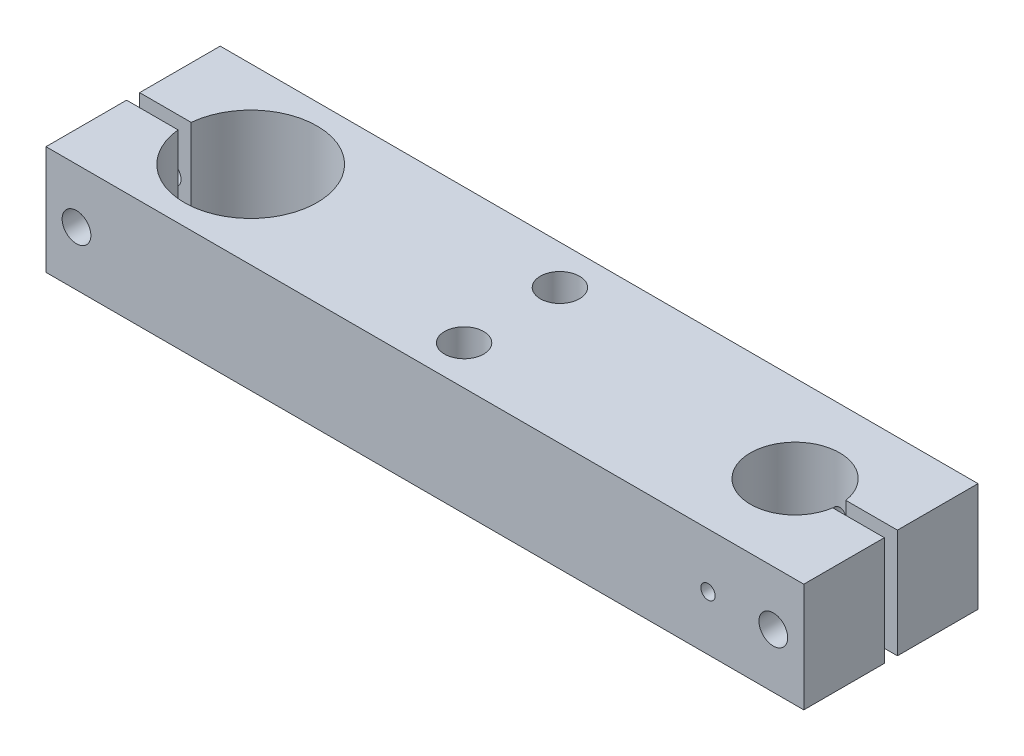
ISO-10303-21;
HEADER;
FILE_DESCRIPTION(('STEP AP214'),'2;1');
FILE_NAME('part.step','',(''),(''),'','','');
FILE_SCHEMA(('AUTOMOTIVE_DESIGN { 1 0 10303 214 1 1 1 1 }'));
ENDSEC;
DATA;
#1=APPLICATION_CONTEXT('core data for automotive mechanical design processes');
#2=APPLICATION_PROTOCOL_DEFINITION('international standard','automotive_design',2000,#1);
#3=PRODUCT_CONTEXT('',#1,'mechanical');
#4=PRODUCT('Part','Part','',(#3));
#5=PRODUCT_RELATED_PRODUCT_CATEGORY('part','',(#4));
#6=PRODUCT_DEFINITION_FORMATION('','',#4);
#7=PRODUCT_DEFINITION_CONTEXT('part definition',#1,'design');
#8=PRODUCT_DEFINITION('design','',#6,#7);
#9=PRODUCT_DEFINITION_SHAPE('','',#8);
#10=(LENGTH_UNIT() NAMED_UNIT(*) SI_UNIT(.MILLI.,.METRE.));
#11=(NAMED_UNIT(*) PLANE_ANGLE_UNIT() SI_UNIT($,.RADIAN.));
#12=(NAMED_UNIT(*) SI_UNIT($,.STERADIAN.) SOLID_ANGLE_UNIT());
#13=UNCERTAINTY_MEASURE_WITH_UNIT(LENGTH_MEASURE(1.E-05),#10,'distance_accuracy_value','');
#14=(GEOMETRIC_REPRESENTATION_CONTEXT(3) GLOBAL_UNCERTAINTY_ASSIGNED_CONTEXT((#13)) GLOBAL_UNIT_ASSIGNED_CONTEXT((#10,
#11,#12)) REPRESENTATION_CONTEXT('',''));
#15=CARTESIAN_POINT('',(0.,0.,0.));
#16=DIRECTION('',(0.,0.,1.));
#17=DIRECTION('',(1.,0.,0.));
#18=AXIS2_PLACEMENT_3D('',#15,#16,#17);
#19=CARTESIAN_POINT('',(0.,25.,20.));
#20=DIRECTION('',(0.,0.,-1.));
#21=DIRECTION('',(-1.,0.,0.));
#22=AXIS2_PLACEMENT_3D('',#19,#20,#21);
#23=PLANE('',#22);
#24=CARTESIAN_POINT('',(65.,12.5,20.));
#25=DIRECTION('',(0.,0.,1.));
#26=DIRECTION('',(1.,0.,0.));
#27=AXIS2_PLACEMENT_3D('',#24,#25,#26);
#28=CIRCLE('',#27,1.65);
#29=CARTESIAN_POINT('',(66.65,12.5,20.));
#30=VERTEX_POINT('',#29);
#31=EDGE_CURVE('E206',#30,#30,#28,.T.);
#32=ORIENTED_EDGE('',*,*,#31,.F.);
#33=EDGE_LOOP('',(#32));
#34=FACE_BOUND('',#33,.T.);
#35=CARTESIAN_POINT('',(-79.9999999999999,12.5,20.));
#36=DIRECTION('',(0.,0.,1.));
#37=DIRECTION('',(1.,0.,0.));
#38=AXIS2_PLACEMENT_3D('',#35,#36,#37);
#39=CIRCLE('',#38,3.3);
#40=CARTESIAN_POINT('',(-76.6999999999999,12.5,20.));
#41=VERTEX_POINT('',#40);
#42=EDGE_CURVE('E181',#41,#41,#39,.T.);
#43=ORIENTED_EDGE('',*,*,#42,.F.);
#44=EDGE_LOOP('',(#43));
#45=FACE_BOUND('',#44,.T.);
#46=DIRECTION('',(1.,0.,0.));
#47=VECTOR('',#46,1.);
#48=CARTESIAN_POINT('',(0.,0.,20.));
#49=LINE('',#48,#47);
#50=CARTESIAN_POINT('',(-87.,0.,20.));
#51=VERTEX_POINT('',#50);
#52=CARTESIAN_POINT('',(87.,0.,20.));
#53=VERTEX_POINT('',#52);
#54=EDGE_CURVE('E276',#51,#53,#49,.T.);
#55=ORIENTED_EDGE('',*,*,#54,.T.);
#56=DIRECTION('',(0.,-1.,0.));
#57=VECTOR('',#56,1.);
#58=CARTESIAN_POINT('',(87.,25.,20.));
#59=LINE('',#58,#57);
#60=CARTESIAN_POINT('',(87.,25.,20.));
#61=VERTEX_POINT('',#60);
#62=EDGE_CURVE('E303',#61,#53,#59,.T.);
#63=ORIENTED_EDGE('',*,*,#62,.F.);
#64=DIRECTION('',(1.,0.,0.));
#65=VECTOR('',#64,1.);
#66=CARTESIAN_POINT('',(0.,25.,20.));
#67=LINE('',#66,#65);
#68=CARTESIAN_POINT('',(-87.,25.,20.));
#69=VERTEX_POINT('',#68);
#70=EDGE_CURVE('E165',#69,#61,#67,.T.);
#71=ORIENTED_EDGE('',*,*,#70,.F.);
#72=DIRECTION('',(0.,-1.,0.));
#73=VECTOR('',#72,1.);
#74=CARTESIAN_POINT('',(-87.,25.,20.));
#75=LINE('',#74,#73);
#76=EDGE_CURVE('E306',#69,#51,#75,.T.);
#77=ORIENTED_EDGE('',*,*,#76,.T.);
#78=EDGE_LOOP('',(#55,#63,#71,#77));
#79=FACE_BOUND('',#78,.T.);
#80=CARTESIAN_POINT('',(80.,12.5,20.));
#81=DIRECTION('',(0.,0.,1.));
#82=DIRECTION('',(1.,0.,0.));
#83=AXIS2_PLACEMENT_3D('',#80,#81,#82);
#84=CIRCLE('',#83,3.3);
#85=CARTESIAN_POINT('',(83.3,12.5,20.));
#86=VERTEX_POINT('',#85);
#87=EDGE_CURVE('E187',#86,#86,#84,.T.);
#88=ORIENTED_EDGE('',*,*,#87,.F.);
#89=EDGE_LOOP('',(#88));
#90=FACE_BOUND('',#89,.T.);
#91=ADVANCED_FACE('F39',(#34,#45,#79,#90),#23,.F.);
#92=CARTESIAN_POINT('',(-60.,25.,0.));
#93=DIRECTION('',(0.,-1.,0.));
#94=DIRECTION('',(0.,0.,-1.));
#95=AXIS2_PLACEMENT_3D('',#92,#93,#94);
#96=CYLINDRICAL_SURFACE('',#95,15.25);
#97=CARTESIAN_POINT('',(-60.,0.,0.));
#98=DIRECTION('',(0.,1.,0.));
#99=DIRECTION('',(0.,0.,1.));
#100=AXIS2_PLACEMENT_3D('',#97,#98,#99);
#101=CIRCLE('',#100,15.25);
#102=CARTESIAN_POINT('',(-75.1760502107762,0.,1.5));
#103=VERTEX_POINT('',#102);
#104=CARTESIAN_POINT('',(-75.1760502107762,0.,-1.5));
#105=VERTEX_POINT('',#104);
#106=EDGE_CURVE('E180',#103,#105,#101,.T.);
#107=ORIENTED_EDGE('',*,*,#106,.F.);
#108=DIRECTION('',(0.,-1.,0.));
#109=VECTOR('',#108,1.);
#110=CARTESIAN_POINT('',(-75.1760502107762,25.,1.5));
#111=LINE('',#110,#109);
#112=CARTESIAN_POINT('',(-75.1760502107762,25.,1.5));
#113=VERTEX_POINT('',#112);
#114=EDGE_CURVE('E11',#113,#103,#111,.T.);
#115=ORIENTED_EDGE('',*,*,#114,.F.);
#116=CARTESIAN_POINT('',(-60.,25.,0.));
#117=DIRECTION('',(0.,1.,0.));
#118=DIRECTION('',(0.,0.,1.));
#119=AXIS2_PLACEMENT_3D('',#116,#117,#118);
#120=CIRCLE('',#119,15.25);
#121=CARTESIAN_POINT('',(-75.1760502107762,25.,-1.5));
#122=VERTEX_POINT('',#121);
#123=EDGE_CURVE('E171',#113,#122,#120,.T.);
#124=ORIENTED_EDGE('',*,*,#123,.T.);
#125=DIRECTION('',(0.,-1.,0.));
#126=VECTOR('',#125,1.);
#127=CARTESIAN_POINT('',(-75.1760502107762,25.,-1.5));
#128=LINE('',#127,#126);
#129=EDGE_CURVE('E108',#122,#105,#128,.T.);
#130=ORIENTED_EDGE('',*,*,#129,.T.);
#131=EDGE_LOOP('',(#107,#115,#124,#130));
#132=FACE_BOUND('',#131,.T.);
#133=ADVANCED_FACE('F41',(#132),#96,.F.);
#134=CARTESIAN_POINT('',(0.,25.,1.49999999999997));
#135=DIRECTION('',(0.,0.,-1.));
#136=DIRECTION('',(-1.,0.,0.));
#137=AXIS2_PLACEMENT_3D('',#134,#135,#136);
#138=PLANE('',#137);
#139=CARTESIAN_POINT('',(-79.9999999999999,12.5,1.5));
#140=DIRECTION('',(0.,0.,-1.));
#141=DIRECTION('',(-1.,0.,0.));
#142=AXIS2_PLACEMENT_3D('',#139,#140,#141);
#143=CIRCLE('',#142,3.3);
#144=CARTESIAN_POINT('',(-83.2999999999999,12.5,1.50000000000001));
#145=VERTEX_POINT('',#144);
#146=EDGE_CURVE('E177',#145,#145,#143,.T.);
#147=ORIENTED_EDGE('',*,*,#146,.F.);
#148=EDGE_LOOP('',(#147));
#149=FACE_BOUND('',#148,.T.);
#150=DIRECTION('',(1.,0.,0.));
#151=VECTOR('',#150,1.);
#152=CARTESIAN_POINT('',(0.,0.,1.49999999999997));
#153=LINE('',#152,#151);
#154=CARTESIAN_POINT('',(-87.,0.,1.50000000000001));
#155=VERTEX_POINT('',#154);
#156=EDGE_CURVE('E267',#155,#103,#153,.T.);
#157=ORIENTED_EDGE('',*,*,#156,.F.);
#158=DIRECTION('',(0.,-1.,0.));
#159=VECTOR('',#158,1.);
#160=CARTESIAN_POINT('',(-87.,25.,1.50000000000001));
#161=LINE('',#160,#159);
#162=CARTESIAN_POINT('',(-87.,25.,1.50000000000001));
#163=VERTEX_POINT('',#162);
#164=EDGE_CURVE('E53',#163,#155,#161,.T.);
#165=ORIENTED_EDGE('',*,*,#164,.F.);
#166=DIRECTION('',(1.,0.,0.));
#167=VECTOR('',#166,1.);
#168=CARTESIAN_POINT('',(0.,25.,1.49999999999997));
#169=LINE('',#168,#167);
#170=EDGE_CURVE('E166',#163,#113,#169,.T.);
#171=ORIENTED_EDGE('',*,*,#170,.T.);
#172=ORIENTED_EDGE('',*,*,#114,.T.);
#173=EDGE_LOOP('',(#157,#165,#171,#172));
#174=FACE_BOUND('',#173,.T.);
#175=ADVANCED_FACE('F251',(#149,#174),#138,.T.);
#176=CARTESIAN_POINT('',(-87.,25.,0.));
#177=DIRECTION('',(-1.,0.,0.));
#178=DIRECTION('',(0.,0.,1.));
#179=AXIS2_PLACEMENT_3D('',#176,#177,#178);
#180=PLANE('',#179);
#181=DIRECTION('',(0.,0.,-1.));
#182=VECTOR('',#181,1.);
#183=CARTESIAN_POINT('',(-87.,0.,0.));
#184=LINE('',#183,#182);
#185=EDGE_CURVE('E271',#51,#155,#184,.T.);
#186=ORIENTED_EDGE('',*,*,#185,.F.);
#187=ORIENTED_EDGE('',*,*,#76,.F.);
#188=DIRECTION('',(0.,0.,-1.));
#189=VECTOR('',#188,1.);
#190=CARTESIAN_POINT('',(-87.,25.,0.));
#191=LINE('',#190,#189);
#192=EDGE_CURVE('E160',#69,#163,#191,.T.);
#193=ORIENTED_EDGE('',*,*,#192,.T.);
#194=ORIENTED_EDGE('',*,*,#164,.T.);
#195=EDGE_LOOP('',(#186,#187,#193,#194));
#196=FACE_BOUND('',#195,.T.);
#197=ADVANCED_FACE('F257',(#196),#180,.T.);
#198=CARTESIAN_POINT('',(87.,25.,0.));
#199=DIRECTION('',(-1.,0.,0.));
#200=DIRECTION('',(0.,0.,1.));
#201=AXIS2_PLACEMENT_3D('',#198,#199,#200);
#202=PLANE('',#201);
#203=DIRECTION('',(0.,0.,-1.));
#204=VECTOR('',#203,1.);
#205=CARTESIAN_POINT('',(87.,0.,0.));
#206=LINE('',#205,#204);
#207=CARTESIAN_POINT('',(87.,0.,1.50000000000001));
#208=VERTEX_POINT('',#207);
#209=EDGE_CURVE('E279',#53,#208,#206,.T.);
#210=ORIENTED_EDGE('',*,*,#209,.T.);
#211=DIRECTION('',(0.,-1.,0.));
#212=VECTOR('',#211,1.);
#213=CARTESIAN_POINT('',(87.,25.,1.50000000000001));
#214=LINE('',#213,#212);
#215=CARTESIAN_POINT('',(87.,25.,1.50000000000001));
#216=VERTEX_POINT('',#215);
#217=EDGE_CURVE('E300',#216,#208,#214,.T.);
#218=ORIENTED_EDGE('',*,*,#217,.F.);
#219=DIRECTION('',(0.,0.,-1.));
#220=VECTOR('',#219,1.);
#221=CARTESIAN_POINT('',(87.,25.,0.));
#222=LINE('',#221,#220);
#223=EDGE_CURVE('E169',#61,#216,#222,.T.);
#224=ORIENTED_EDGE('',*,*,#223,.F.);
#225=ORIENTED_EDGE('',*,*,#62,.T.);
#226=EDGE_LOOP('',(#210,#218,#224,#225));
#227=FACE_BOUND('',#226,.T.);
#228=ADVANCED_FACE('F262',(#227),#202,.F.);
#229=CARTESIAN_POINT('',(0.,25.,1.50000000000002));
#230=DIRECTION('',(0.,0.,1.));
#231=DIRECTION('',(1.,0.,0.));
#232=AXIS2_PLACEMENT_3D('',#229,#230,#231);
#233=PLANE('',#232);
#234=CARTESIAN_POINT('',(80.,12.5,1.50000000000001));
#235=DIRECTION('',(0.,0.,1.));
#236=DIRECTION('',(1.,0.,0.));
#237=AXIS2_PLACEMENT_3D('',#234,#235,#236);
#238=CIRCLE('',#237,3.3);
#239=CARTESIAN_POINT('',(83.3,12.5,1.50000000000001));
#240=VERTEX_POINT('',#239);
#241=EDGE_CURVE('E184',#240,#240,#238,.T.);
#242=ORIENTED_EDGE('',*,*,#241,.T.);
#243=EDGE_LOOP('',(#242));
#244=FACE_BOUND('',#243,.T.);
#245=DIRECTION('',(-1.,0.,0.));
#246=VECTOR('',#245,1.);
#247=CARTESIAN_POINT('',(0.,0.,1.50000000000002));
#248=LINE('',#247,#246);
#249=CARTESIAN_POINT('',(75.1396498953367,0.,1.50000000000001));
#250=VERTEX_POINT('',#249);
#251=EDGE_CURVE('E363',#208,#250,#248,.T.);
#252=ORIENTED_EDGE('',*,*,#251,.T.);
#253=DIRECTION('',(0.,-1.,0.));
#254=VECTOR('',#253,1.);
#255=CARTESIAN_POINT('',(75.1396498953367,25.,1.50000000000001));
#256=LINE('',#255,#254);
#257=CARTESIAN_POINT('',(75.1396498953367,25.,1.50000000000001));
#258=VERTEX_POINT('',#257);
#259=EDGE_CURVE('E298',#258,#250,#256,.T.);
#260=ORIENTED_EDGE('',*,*,#259,.F.);
#261=DIRECTION('',(-1.,0.,0.));
#262=VECTOR('',#261,1.);
#263=CARTESIAN_POINT('',(0.,25.,1.50000000000002));
#264=LINE('',#263,#262);
#265=EDGE_CURVE('E374',#216,#258,#264,.T.);
#266=ORIENTED_EDGE('',*,*,#265,.F.);
#267=ORIENTED_EDGE('',*,*,#217,.T.);
#268=EDGE_LOOP('',(#252,#260,#266,#267));
#269=FACE_BOUND('',#268,.T.);
#270=ADVANCED_FACE('F255',(#244,#269),#233,.F.);
#271=CARTESIAN_POINT('',(65.,25.,0.));
#272=DIRECTION('',(0.,-1.,0.));
#273=DIRECTION('',(0.,0.,-1.));
#274=AXIS2_PLACEMENT_3D('',#271,#272,#273);
#275=CYLINDRICAL_SURFACE('',#274,10.25);
#276=CARTESIAN_POINT('',(66.65,12.5,-10.1163234428324));
#277=CARTESIAN_POINT('',(66.6499962632079,12.5920346989616,-10.1163250645216));
#278=CARTESIAN_POINT('',(66.6422735848861,12.6841207764296,-10.1175929948316));
#279=CARTESIAN_POINT('',(66.6115984950598,12.8657123893667,-10.1225235184145));
#280=CARTESIAN_POINT('',(66.588631752843,12.955215413852,-10.1261883649445));
#281=CARTESIAN_POINT('',(66.5281785302976,13.1289864438415,-10.1354871252178));
#282=CARTESIAN_POINT('',(66.4907038341662,13.2132586338349,-10.1411194405076));
#283=CARTESIAN_POINT('',(66.4023272764388,13.3743090002143,-10.1537166267395));
#284=CARTESIAN_POINT('',(66.351427044533,13.45108808462,-10.1606813359176));
#285=CARTESIAN_POINT('',(66.2371444117006,13.5956894747428,-10.1752301972479));
#286=CARTESIAN_POINT('',(66.1736626748986,13.6634328172087,-10.1828189780707));
#287=CARTESIAN_POINT('',(66.0362336683077,13.7873544343394,-10.1977197330743));
#288=CARTESIAN_POINT('',(65.9622857947744,13.8435320413697,-10.2050316912555));
#289=CARTESIAN_POINT('',(65.8055139581374,13.9430221544765,-10.2186037372556));
#290=CARTESIAN_POINT('',(65.7226429554416,13.9862614366006,-10.2248577542201));
#291=CARTESIAN_POINT('',(65.5506967300398,14.0581771069647,-10.2355578341377));
#292=CARTESIAN_POINT('',(65.461621884338,14.0868543792537,-10.2400040068406));
#293=CARTESIAN_POINT('',(65.2806114413903,14.1285912100333,-10.2465547663992));
#294=CARTESIAN_POINT('',(65.1887071325895,14.1417832971582,-10.2486792125649));
#295=CARTESIAN_POINT('',(65.0039665782541,14.1525871800779,-10.2504153245496));
#296=CARTESIAN_POINT('',(64.9111303923713,14.1501999668707,-10.2500271501963));
#297=CARTESIAN_POINT('',(64.7280668092567,14.1300168021259,-10.2467975303243));
#298=CARTESIAN_POINT('',(64.6378232312549,14.112363460453,-10.2439787908391));
#299=CARTESIAN_POINT('',(64.4615961383037,14.0623734622101,-10.2362300589107));
#300=CARTESIAN_POINT('',(64.3756127462607,14.0300363822873,-10.2313000055956));
#301=CARTESIAN_POINT('',(64.2099200084344,13.9514536095219,-10.2198437913574));
#302=CARTESIAN_POINT('',(64.1302392320002,13.9051487053851,-10.2133108580808));
#303=CARTESIAN_POINT('',(63.9797249990491,13.799988036499,-10.1993755108456));
#304=CARTESIAN_POINT('',(63.9088922122111,13.7411313226512,-10.1919730311557));
#305=CARTESIAN_POINT('',(63.7772427359229,13.6117455515025,-10.1770237355564));
#306=CARTESIAN_POINT('',(63.7165485157406,13.5410918960937,-10.1694762343532));
#307=CARTESIAN_POINT('',(63.6078576235547,13.3905388896829,-10.1551688424713));
#308=CARTESIAN_POINT('',(63.559861053966,13.3106394641151,-10.1484089581453));
#309=CARTESIAN_POINT('',(63.4779065024358,13.1437260184039,-10.1364420141689));
#310=CARTESIAN_POINT('',(63.4439625033016,13.0567050146334,-10.1312365026029));
#311=CARTESIAN_POINT('',(63.3912072446811,12.8780941489212,-10.1229939071746));
#312=CARTESIAN_POINT('',(63.3723947474124,12.7865046613401,-10.1199566459481));
#313=CARTESIAN_POINT('',(63.3506073747194,12.6024503206324,-10.1164285273994));
#314=CARTESIAN_POINT('',(63.3474582618784,12.5100066119582,-10.1159096574037));
#315=CARTESIAN_POINT('',(63.3566234341574,12.3259125127684,-10.1174025419156));
#316=CARTESIAN_POINT('',(63.368937163724,12.2342620938704,-10.1194142055055));
#317=CARTESIAN_POINT('',(63.4085301958762,12.0549048322296,-10.1257156647006));
#318=CARTESIAN_POINT('',(63.4357214748808,11.9671780458938,-10.1299920562287));
#319=CARTESIAN_POINT('',(63.5042056940618,11.7975267388801,-10.1403299510429));
#320=CARTESIAN_POINT('',(63.5454994265292,11.7156025445104,-10.1463915546214));
#321=CARTESIAN_POINT('',(63.641430206745,11.5591045136705,-10.1596822937066));
#322=CARTESIAN_POINT('',(63.6961793106063,11.4846001974908,-10.1669210517745));
#323=CARTESIAN_POINT('',(63.8173122125562,11.3457741217174,-10.1817220380688));
#324=CARTESIAN_POINT('',(63.8836967720391,11.2814530290122,-10.1892842874393));
#325=CARTESIAN_POINT('',(64.0269865012623,11.1641867010377,-10.2039684178276));
#326=CARTESIAN_POINT('',(64.1039871418619,11.1113574085429,-10.2110853368954));
#327=CARTESIAN_POINT('',(64.2658716764846,11.0193848951301,-10.2239982139765));
#328=CARTESIAN_POINT('',(64.3507553288726,10.980241254886,-10.2297942124607));
#329=CARTESIAN_POINT('',(64.5256457394114,10.9169333237307,-10.2393905692708));
#330=CARTESIAN_POINT('',(64.6156297195026,10.8927074037296,-10.2431991281467));
#331=CARTESIAN_POINT('',(64.7984549320864,10.8597237818002,-10.2484260686483));
#332=CARTESIAN_POINT('',(64.89129594536,10.8509648960888,-10.2498446331941));
#333=CARTESIAN_POINT('',(65.0760788423923,10.8491962173098,-10.2501294315423));
#334=CARTESIAN_POINT('',(65.1680190384366,10.8560096686285,-10.2490243108448));
#335=CARTESIAN_POINT('',(65.349427682934,10.8848111570171,-10.2444441337809));
#336=CARTESIAN_POINT('',(65.438896143019,10.9067991226636,-10.2409690885693));
#337=CARTESIAN_POINT('',(65.6127607944378,10.9652594309524,-10.2320379616861));
#338=CARTESIAN_POINT('',(65.6971618151889,11.0017177223432,-10.226583802251));
#339=CARTESIAN_POINT('',(65.8586761864078,11.0880643970013,-10.2142911329504));
#340=CARTESIAN_POINT('',(65.9357892290539,11.1379533471958,-10.2074525646501));
#341=CARTESIAN_POINT('',(66.0814313069313,11.25037625383,-10.1930577745196));
#342=CARTESIAN_POINT('',(66.149859453342,11.3130400389885,-10.1854946449556));
#343=CARTESIAN_POINT('',(66.2752921826587,11.4489609568735,-10.1705521114206));
#344=CARTESIAN_POINT('',(66.3322940854736,11.522220567991,-10.1631727509085));
#345=CARTESIAN_POINT('',(66.4335967702141,11.6778216074984,-10.1493811996165));
#346=CARTESIAN_POINT('',(66.4778119204254,11.7602193750555,-10.1429756599047));
#347=CARTESIAN_POINT('',(66.5517067232382,11.9313400206916,-10.1319353591568));
#348=CARTESIAN_POINT('',(66.5814010965313,12.0200563881815,-10.1272988058326));
#349=CARTESIAN_POINT('',(66.6188595810984,12.1742812129117,-10.1213649528678));
#350=CARTESIAN_POINT('',(66.6305188122742,12.2388489624894,-10.1194847248139));
#351=CARTESIAN_POINT('',(66.6460902895875,12.368935798639,-10.11696340237));
#352=CARTESIAN_POINT('',(66.6500026612629,12.4344548697776,-10.1163222879002));
#353=CARTESIAN_POINT('',(66.65,12.5,-10.1163234428324));
#354=B_SPLINE_CURVE_WITH_KNOTS('',3,(#276,#277,#278,#279,#280,#281,#282,#283,#284,#285,#286,
#287,#288,#289,#290,#291,#292,#293,#294,#295,#296,#297,#298,#299,#300,#301,#302,#303,#304,#305,
#306,#307,#308,#309,#310,#311,#312,#313,#314,#315,#316,#317,#318,#319,#320,#321,#322,#323,#324,
#325,#326,#327,#328,#329,#330,#331,#332,#333,#334,#335,#336,#337,#338,#339,#340,#341,#342,#343,
#344,#345,#346,#347,#348,#349,#350,#351,#352,#353),.UNSPECIFIED.,.T.,.F.,(4,2,2,2,2,2,2,2,2,2,2,
2,2,2,2,2,2,2,2,2,2,2,2,2,2,2,2,2,2,2,2,2,2,2,2,2,2,2,4),(0.,0.275864450470175,
0.551988604911592,0.827888944365757,1.10375580840997,1.38189436557629,1.6600489738505,
1.93974924208297,2.21943252788789,2.49670430039843,2.77395843584607,3.04865021723867,
3.32334991888206,3.59923087300143,3.87513269511534,4.15415797189366,4.43318549912625,
4.71249000519644,4.99177166136193,5.26793956707235,5.54409755082674,5.81863903124487,
6.09319593823815,6.37012180901307,6.64706580787802,6.92668617939729,7.20629798264193,
7.48474674578487,7.76317419668121,8.03845704146743,8.31373859055804,8.58875348194182,
8.86377998391179,9.14175494604532,9.41979503270759,9.69965615474594,9.9792329714501,
10.1757008748941,10.3721655945468),.UNSPECIFIED.);
#355=CARTESIAN_POINT('',(66.65,12.5,-10.1163234428324));
#356=VERTEX_POINT('',#355);
#357=EDGE_CURVE('E43',#356,#356,#354,.T.);
#358=ORIENTED_EDGE('',*,*,#357,.F.);
#359=EDGE_LOOP('',(#358));
#360=FACE_BOUND('',#359,.T.);
#361=CARTESIAN_POINT('',(66.65,12.5,10.1163234428324));
#362=CARTESIAN_POINT('',(66.6499962632079,12.4079653010384,10.1163250645216));
#363=CARTESIAN_POINT('',(66.6422735848861,12.3158792235704,10.1175929948316));
#364=CARTESIAN_POINT('',(66.6115984950598,12.1342876106333,10.1225235184145));
#365=CARTESIAN_POINT('',(66.588631752843,12.0447845861481,10.1261883649445));
#366=CARTESIAN_POINT('',(66.5281785302976,11.8710135561585,10.1354871252178));
#367=CARTESIAN_POINT('',(66.4907038341662,11.7867413661651,10.1411194405076));
#368=CARTESIAN_POINT('',(66.4023272764388,11.6256909997857,10.1537166267395));
#369=CARTESIAN_POINT('',(66.351427044533,11.54891191538,10.1606813359176));
#370=CARTESIAN_POINT('',(66.2371444117006,11.4043105252572,10.1752301972479));
#371=CARTESIAN_POINT('',(66.1736626748986,11.3365671827913,10.1828189780708));
#372=CARTESIAN_POINT('',(66.0362336683077,11.2126455656606,10.1977197330743));
#373=CARTESIAN_POINT('',(65.9622857947744,11.1564679586303,10.2050316912555));
#374=CARTESIAN_POINT('',(65.8055139581374,11.0569778455235,10.2186037372557));
#375=CARTESIAN_POINT('',(65.7226429554416,11.0137385633994,10.2248577542201));
#376=CARTESIAN_POINT('',(65.5506967300398,10.9418228930353,10.2355578341378));
#377=CARTESIAN_POINT('',(65.461621884338,10.9131456207463,10.2400040068406));
#378=CARTESIAN_POINT('',(65.2806114413903,10.8714087899667,10.2465547663992));
#379=CARTESIAN_POINT('',(65.1887071325895,10.8582167028418,10.2486792125649));
#380=CARTESIAN_POINT('',(65.0039665782541,10.8474128199221,10.2504153245496));
#381=CARTESIAN_POINT('',(64.9111303923713,10.8498000331293,10.2500271501963));
#382=CARTESIAN_POINT('',(64.7280668092567,10.8699831978741,10.2467975303243));
#383=CARTESIAN_POINT('',(64.6378232312549,10.887636539547,10.2439787908391));
#384=CARTESIAN_POINT('',(64.4615961383037,10.9376265377899,10.2362300589107));
#385=CARTESIAN_POINT('',(64.3756127462607,10.9699636177127,10.2313000055956));
#386=CARTESIAN_POINT('',(64.2099200084344,11.0485463904781,10.2198437913575));
#387=CARTESIAN_POINT('',(64.1302392320002,11.0948512946149,10.2133108580808));
#388=CARTESIAN_POINT('',(63.9797249990491,11.200011963501,10.1993755108456));
#389=CARTESIAN_POINT('',(63.9088922122111,11.2588686773488,10.1919730311557));
#390=CARTESIAN_POINT('',(63.7772427359229,11.3882544484975,10.1770237355564));
#391=CARTESIAN_POINT('',(63.7165485157406,11.4589081039063,10.1694762343533));
#392=CARTESIAN_POINT('',(63.6078576235547,11.6094611103171,10.1551688424713));
#393=CARTESIAN_POINT('',(63.559861053966,11.6893605358849,10.1484089581453));
#394=CARTESIAN_POINT('',(63.4779065024358,11.8562739815961,10.1364420141689));
#395=CARTESIAN_POINT('',(63.4439625033016,11.9432949853666,10.1312365026029));
#396=CARTESIAN_POINT('',(63.3912072446811,12.1219058510788,10.1229939071746));
#397=CARTESIAN_POINT('',(63.3723947474124,12.2134953386599,10.1199566459481));
#398=CARTESIAN_POINT('',(63.3506073747194,12.3975496793676,10.1164285273994));
#399=CARTESIAN_POINT('',(63.3474582618784,12.4899933880418,10.1159096574037));
#400=CARTESIAN_POINT('',(63.3566234341574,12.6740874872316,10.1174025419157));
#401=CARTESIAN_POINT('',(63.368937163724,12.7657379061296,10.1194142055055));
#402=CARTESIAN_POINT('',(63.4085301958762,12.9450951677704,10.1257156647007));
#403=CARTESIAN_POINT('',(63.4357214748808,13.0328219541062,10.1299920562288));
#404=CARTESIAN_POINT('',(63.5042056940618,13.2024732611199,10.1403299510429));
#405=CARTESIAN_POINT('',(63.5454994265292,13.2843974554896,10.1463915546214));
#406=CARTESIAN_POINT('',(63.641430206745,13.4408954863295,10.1596822937066));
#407=CARTESIAN_POINT('',(63.6961793106063,13.5153998025092,10.1669210517745));
#408=CARTESIAN_POINT('',(63.8173122125562,13.6542258782826,10.1817220380689));
#409=CARTESIAN_POINT('',(63.8836967720391,13.7185469709878,10.1892842874393));
#410=CARTESIAN_POINT('',(64.0269865012623,13.8358132989623,10.2039684178277));
#411=CARTESIAN_POINT('',(64.1039871418619,13.8886425914571,10.2110853368955));
#412=CARTESIAN_POINT('',(64.2658716764846,13.9806151048699,10.2239982139765));
#413=CARTESIAN_POINT('',(64.3507553288726,14.019758745114,10.2297942124607));
#414=CARTESIAN_POINT('',(64.5256457394114,14.0830666762693,10.2393905692708));
#415=CARTESIAN_POINT('',(64.6156297195026,14.1072925962704,10.2431991281467));
#416=CARTESIAN_POINT('',(64.7984549320864,14.1402762181998,10.2484260686484));
#417=CARTESIAN_POINT('',(64.89129594536,14.1490351039112,10.2498446331941));
#418=CARTESIAN_POINT('',(65.0760788423923,14.1508037826902,10.2501294315424));
#419=CARTESIAN_POINT('',(65.1680190384366,14.1439903313715,10.2490243108448));
#420=CARTESIAN_POINT('',(65.349427682934,14.1151888429829,10.2444441337809));
#421=CARTESIAN_POINT('',(65.438896143019,14.0932008773364,10.2409690885693));
#422=CARTESIAN_POINT('',(65.6127607944378,14.0347405690476,10.2320379616861));
#423=CARTESIAN_POINT('',(65.6971618151889,13.9982822776568,10.2265838022511));
#424=CARTESIAN_POINT('',(65.8586761864078,13.9119356029987,10.2142911329505));
#425=CARTESIAN_POINT('',(65.9357892290539,13.8620466528042,10.2074525646501));
#426=CARTESIAN_POINT('',(66.0814313069313,13.74962374617,10.1930577745197));
#427=CARTESIAN_POINT('',(66.149859453342,13.6869599610115,10.1854946449556));
#428=CARTESIAN_POINT('',(66.2752921826587,13.5510390431265,10.1705521114207));
#429=CARTESIAN_POINT('',(66.3322940854736,13.477779432009,10.1631727509086));
#430=CARTESIAN_POINT('',(66.4335967702141,13.3221783925016,10.1493811996165));
#431=CARTESIAN_POINT('',(66.4778119204254,13.2397806249445,10.1429756599047));
#432=CARTESIAN_POINT('',(66.5517067232382,13.0686599793084,10.1319353591568));
#433=CARTESIAN_POINT('',(66.5814010965313,12.9799436118185,10.1272988058326));
#434=CARTESIAN_POINT('',(66.6188595810984,12.8257187870883,10.1213649528678));
#435=CARTESIAN_POINT('',(66.6305188122742,12.7611510375106,10.1194847248139));
#436=CARTESIAN_POINT('',(66.6460902895875,12.631064201361,10.11696340237));
#437=CARTESIAN_POINT('',(66.6500026612629,12.5655451302224,10.1163222879002));
#438=CARTESIAN_POINT('',(66.65,12.5,10.1163234428324));
#439=B_SPLINE_CURVE_WITH_KNOTS('',3,(#361,#362,#363,#364,#365,#366,#367,#368,#369,#370,#371,
#372,#373,#374,#375,#376,#377,#378,#379,#380,#381,#382,#383,#384,#385,#386,#387,#388,#389,#390,
#391,#392,#393,#394,#395,#396,#397,#398,#399,#400,#401,#402,#403,#404,#405,#406,#407,#408,#409,
#410,#411,#412,#413,#414,#415,#416,#417,#418,#419,#420,#421,#422,#423,#424,#425,#426,#427,#428,
#429,#430,#431,#432,#433,#434,#435,#436,#437,#438),.UNSPECIFIED.,.T.,.F.,(4,2,2,2,2,2,2,2,2,2,2,
2,2,2,2,2,2,2,2,2,2,2,2,2,2,2,2,2,2,2,2,2,2,2,2,2,2,2,4),(0.,0.275864450470173,
0.551988604911592,0.827888944365757,1.10375580840997,1.38189436557629,1.6600489738505,
1.93974924208297,2.21943252788789,2.49670430039843,2.77395843584607,3.04865021723867,
3.32334991888206,3.59923087300143,3.87513269511534,4.15415797189366,4.43318549912625,
4.71249000519644,4.99177166136193,5.26793956707235,5.54409755082674,5.81863903124487,
6.09319593823815,6.37012180901307,6.64706580787802,6.92668617939729,7.20629798264193,
7.48474674578487,7.76317419668121,8.03845704146743,8.31373859055804,8.58875348194182,
8.86377998391179,9.14175494604532,9.41979503270759,9.69965615474594,9.9792329714501,
10.1757008748941,10.3721655945468),.UNSPECIFIED.);
#440=CARTESIAN_POINT('',(66.65,12.5,10.1163234428324));
#441=VERTEX_POINT('',#440);
#442=EDGE_CURVE('E205',#441,#441,#439,.T.);
#443=ORIENTED_EDGE('',*,*,#442,.F.);
#444=EDGE_LOOP('',(#443));
#445=FACE_BOUND('',#444,.T.);
#446=CARTESIAN_POINT('',(65.,0.,0.));
#447=DIRECTION('',(0.,1.,0.));
#448=DIRECTION('',(0.,0.,1.));
#449=AXIS2_PLACEMENT_3D('',#446,#447,#448);
#450=CIRCLE('',#449,10.25);
#451=CARTESIAN_POINT('',(75.1396498953367,0.,-1.49999999999999));
#452=VERTEX_POINT('',#451);
#453=EDGE_CURVE('E362',#452,#250,#450,.T.);
#454=ORIENTED_EDGE('',*,*,#453,.F.);
#455=DIRECTION('',(0.,-1.,0.));
#456=VECTOR('',#455,1.);
#457=CARTESIAN_POINT('',(75.1396498953367,25.,-1.49999999999999));
#458=LINE('',#457,#456);
#459=CARTESIAN_POINT('',(75.1396498953367,25.,-1.49999999999999));
#460=VERTEX_POINT('',#459);
#461=EDGE_CURVE('E296',#460,#452,#458,.T.);
#462=ORIENTED_EDGE('',*,*,#461,.F.);
#463=CARTESIAN_POINT('',(65.,25.,0.));
#464=DIRECTION('',(0.,1.,0.));
#465=DIRECTION('',(0.,0.,1.));
#466=AXIS2_PLACEMENT_3D('',#463,#464,#465);
#467=CIRCLE('',#466,10.25);
#468=EDGE_CURVE('E377',#460,#258,#467,.T.);
#469=ORIENTED_EDGE('',*,*,#468,.T.);
#470=ORIENTED_EDGE('',*,*,#259,.T.);
#471=EDGE_LOOP('',(#454,#462,#469,#470));
#472=FACE_BOUND('',#471,.T.);
#473=ADVANCED_FACE('F311',(#360,#445,#472),#275,.F.);
#474=CARTESIAN_POINT('',(0.,25.,-1.49999999999998));
#475=DIRECTION('',(0.,0.,1.));
#476=DIRECTION('',(1.,0.,0.));
#477=AXIS2_PLACEMENT_3D('',#474,#475,#476);
#478=PLANE('',#477);
#479=CARTESIAN_POINT('',(80.,12.5,-1.49999999999998));
#480=DIRECTION('',(0.,0.,1.));
#481=DIRECTION('',(1.,0.,0.));
#482=AXIS2_PLACEMENT_3D('',#479,#480,#481);
#483=CIRCLE('',#482,2.5);
#484=CARTESIAN_POINT('',(82.5,12.5,-1.49999999999998));
#485=VERTEX_POINT('',#484);
#486=EDGE_CURVE('E199',#485,#485,#483,.T.);
#487=ORIENTED_EDGE('',*,*,#486,.F.);
#488=EDGE_LOOP('',(#487));
#489=FACE_BOUND('',#488,.T.);
#490=DIRECTION('',(-1.,0.,0.));
#491=VECTOR('',#490,1.);
#492=CARTESIAN_POINT('',(0.,0.,-1.49999999999998));
#493=LINE('',#492,#491);
#494=CARTESIAN_POINT('',(87.,0.,-1.49999999999999));
#495=VERTEX_POINT('',#494);
#496=EDGE_CURVE('E286',#495,#452,#493,.T.);
#497=ORIENTED_EDGE('',*,*,#496,.F.);
#498=DIRECTION('',(0.,-1.,0.));
#499=VECTOR('',#498,1.);
#500=CARTESIAN_POINT('',(87.,25.,-1.49999999999999));
#501=LINE('',#500,#499);
#502=CARTESIAN_POINT('',(87.,25.,-1.49999999999999));
#503=VERTEX_POINT('',#502);
#504=EDGE_CURVE('E294',#503,#495,#501,.T.);
#505=ORIENTED_EDGE('',*,*,#504,.F.);
#506=DIRECTION('',(-1.,0.,0.));
#507=VECTOR('',#506,1.);
#508=CARTESIAN_POINT('',(0.,25.,-1.49999999999998));
#509=LINE('',#508,#507);
#510=EDGE_CURVE('E379',#503,#460,#509,.T.);
#511=ORIENTED_EDGE('',*,*,#510,.T.);
#512=ORIENTED_EDGE('',*,*,#461,.T.);
#513=EDGE_LOOP('',(#497,#505,#511,#512));
#514=FACE_BOUND('',#513,.T.);
#515=ADVANCED_FACE('F347',(#489,#514),#478,.T.);
#516=CARTESIAN_POINT('',(87.,0.,-20.));
#517=VERTEX_POINT('',#516);
#518=EDGE_CURVE('E282',#495,#517,#206,.T.);
#519=ORIENTED_EDGE('',*,*,#518,.T.);
#520=DIRECTION('',(0.,-1.,0.));
#521=VECTOR('',#520,1.);
#522=CARTESIAN_POINT('',(87.,25.,-20.));
#523=LINE('',#522,#521);
#524=CARTESIAN_POINT('',(87.,25.,-20.));
#525=VERTEX_POINT('',#524);
#526=EDGE_CURVE('E149',#525,#517,#523,.T.);
#527=ORIENTED_EDGE('',*,*,#526,.F.);
#528=EDGE_CURVE('E155',#503,#525,#222,.T.);
#529=ORIENTED_EDGE('',*,*,#528,.F.);
#530=ORIENTED_EDGE('',*,*,#504,.T.);
#531=EDGE_LOOP('',(#519,#527,#529,#530));
#532=FACE_BOUND('',#531,.T.);
#533=ADVANCED_FACE('F344',(#532),#202,.F.);
#534=CARTESIAN_POINT('',(0.,25.,-20.));
#535=DIRECTION('',(0.,0.,-1.));
#536=DIRECTION('',(-1.,0.,0.));
#537=AXIS2_PLACEMENT_3D('',#534,#535,#536);
#538=PLANE('',#537);
#539=CARTESIAN_POINT('',(65.,12.5,-20.));
#540=DIRECTION('',(0.,0.,1.));
#541=DIRECTION('',(1.,0.,0.));
#542=AXIS2_PLACEMENT_3D('',#539,#540,#541);
#543=CIRCLE('',#542,1.64999999999998);
#544=CARTESIAN_POINT('',(66.65,12.5,-20.));
#545=VERTEX_POINT('',#544);
#546=EDGE_CURVE('E202',#545,#545,#543,.T.);
#547=ORIENTED_EDGE('',*,*,#546,.T.);
#548=EDGE_LOOP('',(#547));
#549=FACE_BOUND('',#548,.T.);
#550=CARTESIAN_POINT('',(80.,12.5,-20.));
#551=DIRECTION('',(0.,0.,1.));
#552=DIRECTION('',(1.,0.,0.));
#553=AXIS2_PLACEMENT_3D('',#550,#551,#552);
#554=CIRCLE('',#553,2.5);
#555=CARTESIAN_POINT('',(82.5,12.5,-20.));
#556=VERTEX_POINT('',#555);
#557=EDGE_CURVE('E196',#556,#556,#554,.T.);
#558=ORIENTED_EDGE('',*,*,#557,.T.);
#559=EDGE_LOOP('',(#558));
#560=FACE_BOUND('',#559,.T.);
#561=CARTESIAN_POINT('',(-79.9999999999999,12.5,-20.));
#562=DIRECTION('',(0.,0.,1.));
#563=DIRECTION('',(1.,0.,0.));
#564=AXIS2_PLACEMENT_3D('',#561,#562,#563);
#565=CIRCLE('',#564,2.5);
#566=CARTESIAN_POINT('',(-77.4999999999999,12.5,-20.));
#567=VERTEX_POINT('',#566);
#568=EDGE_CURVE('E190',#567,#567,#565,.T.);
#569=ORIENTED_EDGE('',*,*,#568,.T.);
#570=EDGE_LOOP('',(#569));
#571=FACE_BOUND('',#570,.T.);
#572=DIRECTION('',(1.,0.,0.));
#573=VECTOR('',#572,1.);
#574=CARTESIAN_POINT('',(0.,0.,-20.));
#575=LINE('',#574,#573);
#576=CARTESIAN_POINT('',(-87.,0.,-20.));
#577=VERTEX_POINT('',#576);
#578=EDGE_CURVE('E144',#577,#517,#575,.T.);
#579=ORIENTED_EDGE('',*,*,#578,.F.);
#580=DIRECTION('',(0.,-1.,0.));
#581=VECTOR('',#580,1.);
#582=CARTESIAN_POINT('',(-87.,25.,-20.));
#583=LINE('',#582,#581);
#584=CARTESIAN_POINT('',(-87.,25.,-20.));
#585=VERTEX_POINT('',#584);
#586=EDGE_CURVE('E139',#585,#577,#583,.T.);
#587=ORIENTED_EDGE('',*,*,#586,.F.);
#588=DIRECTION('',(1.,0.,0.));
#589=VECTOR('',#588,1.);
#590=CARTESIAN_POINT('',(0.,25.,-20.));
#591=LINE('',#590,#589);
#592=EDGE_CURVE('E142',#585,#525,#591,.T.);
#593=ORIENTED_EDGE('',*,*,#592,.T.);
#594=ORIENTED_EDGE('',*,*,#526,.T.);
#595=EDGE_LOOP('',(#579,#587,#593,#594));
#596=FACE_BOUND('',#595,.T.);
#597=ADVANCED_FACE('F141',(#549,#560,#571,#596),#538,.T.);
#598=CARTESIAN_POINT('',(-87.,0.,-1.49999999999999));
#599=VERTEX_POINT('',#598);
#600=EDGE_CURVE('E278',#599,#577,#184,.T.);
#601=ORIENTED_EDGE('',*,*,#600,.F.);
#602=DIRECTION('',(0.,-1.,0.));
#603=VECTOR('',#602,1.);
#604=CARTESIAN_POINT('',(-87.,25.,-1.49999999999999));
#605=LINE('',#604,#603);
#606=CARTESIAN_POINT('',(-87.,25.,-1.49999999999999));
#607=VERTEX_POINT('',#606);
#608=EDGE_CURVE('E101',#607,#599,#605,.T.);
#609=ORIENTED_EDGE('',*,*,#608,.F.);
#610=EDGE_CURVE('E152',#607,#585,#191,.T.);
#611=ORIENTED_EDGE('',*,*,#610,.T.);
#612=ORIENTED_EDGE('',*,*,#586,.T.);
#613=EDGE_LOOP('',(#601,#609,#611,#612));
#614=FACE_BOUND('',#613,.T.);
#615=ADVANCED_FACE('F158',(#614),#180,.T.);
#616=CARTESIAN_POINT('',(0.,25.,-1.50000000000003));
#617=DIRECTION('',(0.,0.,-1.));
#618=DIRECTION('',(-1.,0.,0.));
#619=AXIS2_PLACEMENT_3D('',#616,#617,#618);
#620=PLANE('',#619);
#621=CARTESIAN_POINT('',(-79.9999999999999,12.5,-1.49999999999998));
#622=DIRECTION('',(0.,0.,1.));
#623=DIRECTION('',(1.,0.,0.));
#624=AXIS2_PLACEMENT_3D('',#621,#622,#623);
#625=CIRCLE('',#624,2.5);
#626=CARTESIAN_POINT('',(-77.4999999999999,12.5,-1.49999999999998));
#627=VERTEX_POINT('',#626);
#628=EDGE_CURVE('E193',#627,#627,#625,.T.);
#629=ORIENTED_EDGE('',*,*,#628,.F.);
#630=EDGE_LOOP('',(#629));
#631=FACE_BOUND('',#630,.T.);
#632=DIRECTION('',(1.,0.,0.));
#633=VECTOR('',#632,1.);
#634=CARTESIAN_POINT('',(0.,0.,-1.50000000000003));
#635=LINE('',#634,#633);
#636=EDGE_CURVE('E174',#599,#105,#635,.T.);
#637=ORIENTED_EDGE('',*,*,#636,.T.);
#638=ORIENTED_EDGE('',*,*,#129,.F.);
#639=DIRECTION('',(1.,0.,0.));
#640=VECTOR('',#639,1.);
#641=CARTESIAN_POINT('',(0.,25.,-1.50000000000003));
#642=LINE('',#641,#640);
#643=EDGE_CURVE('E62',#607,#122,#642,.T.);
#644=ORIENTED_EDGE('',*,*,#643,.F.);
#645=ORIENTED_EDGE('',*,*,#608,.T.);
#646=EDGE_LOOP('',(#637,#638,#644,#645));
#647=FACE_BOUND('',#646,.T.);
#648=ADVANCED_FACE('F227',(#631,#647),#620,.F.);
#649=CARTESIAN_POINT('',(0.,25.,0.));
#650=DIRECTION('',(0.,1.,0.));
#651=DIRECTION('',(0.,0.,1.));
#652=AXIS2_PLACEMENT_3D('',#649,#650,#651);
#653=PLANE('',#652);
#654=CARTESIAN_POINT('',(0.,25.,-11.));
#655=DIRECTION('',(0.,1.,0.));
#656=DIRECTION('',(0.,0.,1.));
#657=AXIS2_PLACEMENT_3D('',#654,#655,#656);
#658=CIRCLE('',#657,4.5);
#659=CARTESIAN_POINT('',(0.,25.,-6.5));
#660=VERTEX_POINT('',#659);
#661=EDGE_CURVE('E218',#660,#660,#658,.T.);
#662=ORIENTED_EDGE('',*,*,#661,.F.);
#663=EDGE_LOOP('',(#662));
#664=FACE_BOUND('',#663,.T.);
#665=CARTESIAN_POINT('',(0.,25.,11.));
#666=DIRECTION('',(0.,1.,0.));
#667=DIRECTION('',(0.,0.,1.));
#668=AXIS2_PLACEMENT_3D('',#665,#666,#667);
#669=CIRCLE('',#668,4.5);
#670=CARTESIAN_POINT('',(0.,25.,15.5));
#671=VERTEX_POINT('',#670);
#672=EDGE_CURVE('E212',#671,#671,#669,.T.);
#673=ORIENTED_EDGE('',*,*,#672,.F.);
#674=EDGE_LOOP('',(#673));
#675=FACE_BOUND('',#674,.T.);
#676=ORIENTED_EDGE('',*,*,#123,.F.);
#677=ORIENTED_EDGE('',*,*,#170,.F.);
#678=ORIENTED_EDGE('',*,*,#192,.F.);
#679=ORIENTED_EDGE('',*,*,#70,.T.);
#680=ORIENTED_EDGE('',*,*,#223,.T.);
#681=ORIENTED_EDGE('',*,*,#265,.T.);
#682=ORIENTED_EDGE('',*,*,#468,.F.);
#683=ORIENTED_EDGE('',*,*,#510,.F.);
#684=ORIENTED_EDGE('',*,*,#528,.T.);
#685=ORIENTED_EDGE('',*,*,#592,.F.);
#686=ORIENTED_EDGE('',*,*,#610,.F.);
#687=ORIENTED_EDGE('',*,*,#643,.T.);
#688=EDGE_LOOP('',(#676,#677,#678,#679,#680,#681,#682,#683,#684,#685,#686,#687));
#689=FACE_BOUND('',#688,.T.);
#690=ADVANCED_FACE('F151',(#664,#675,#689),#653,.T.);
#691=CARTESIAN_POINT('',(0.,0.,0.));
#692=DIRECTION('',(0.,1.,0.));
#693=DIRECTION('',(0.,0.,1.));
#694=AXIS2_PLACEMENT_3D('',#691,#692,#693);
#695=PLANE('',#694);
#696=CARTESIAN_POINT('',(0.,0.,-11.));
#697=DIRECTION('',(0.,1.,0.));
#698=DIRECTION('',(0.,0.,1.));
#699=AXIS2_PLACEMENT_3D('',#696,#697,#698);
#700=CIRCLE('',#699,4.49999999999999);
#701=CARTESIAN_POINT('',(0.,0.,-6.50000000000001));
#702=VERTEX_POINT('',#701);
#703=EDGE_CURVE('E215',#702,#702,#700,.T.);
#704=ORIENTED_EDGE('',*,*,#703,.T.);
#705=EDGE_LOOP('',(#704));
#706=FACE_BOUND('',#705,.T.);
#707=CARTESIAN_POINT('',(0.,0.,11.));
#708=DIRECTION('',(0.,1.,0.));
#709=DIRECTION('',(0.,0.,1.));
#710=AXIS2_PLACEMENT_3D('',#707,#708,#709);
#711=CIRCLE('',#710,4.49999999999999);
#712=CARTESIAN_POINT('',(0.,0.,15.5));
#713=VERTEX_POINT('',#712);
#714=EDGE_CURVE('E209',#713,#713,#711,.T.);
#715=ORIENTED_EDGE('',*,*,#714,.T.);
#716=EDGE_LOOP('',(#715));
#717=FACE_BOUND('',#716,.T.);
#718=ORIENTED_EDGE('',*,*,#106,.T.);
#719=ORIENTED_EDGE('',*,*,#636,.F.);
#720=ORIENTED_EDGE('',*,*,#600,.T.);
#721=ORIENTED_EDGE('',*,*,#578,.T.);
#722=ORIENTED_EDGE('',*,*,#518,.F.);
#723=ORIENTED_EDGE('',*,*,#496,.T.);
#724=ORIENTED_EDGE('',*,*,#453,.T.);
#725=ORIENTED_EDGE('',*,*,#251,.F.);
#726=ORIENTED_EDGE('',*,*,#209,.F.);
#727=ORIENTED_EDGE('',*,*,#54,.F.);
#728=ORIENTED_EDGE('',*,*,#185,.T.);
#729=ORIENTED_EDGE('',*,*,#156,.T.);
#730=EDGE_LOOP('',(#718,#719,#720,#721,#722,#723,#724,#725,#726,#727,#728,#729));
#731=FACE_BOUND('',#730,.T.);
#732=ADVANCED_FACE('F226',(#706,#717,#731),#695,.F.);
#733=CARTESIAN_POINT('',(-79.9999999999999,12.5,20.));
#734=DIRECTION('',(0.,0.,1.));
#735=DIRECTION('',(1.,0.,0.));
#736=AXIS2_PLACEMENT_3D('',#733,#734,#735);
#737=CYLINDRICAL_SURFACE('',#736,3.3);
#738=ORIENTED_EDGE('',*,*,#42,.T.);
#739=EDGE_LOOP('',(#738));
#740=FACE_BOUND('',#739,.T.);
#741=ORIENTED_EDGE('',*,*,#146,.T.);
#742=EDGE_LOOP('',(#741));
#743=FACE_BOUND('',#742,.T.);
#744=ADVANCED_FACE('F330',(#740,#743),#737,.F.);
#745=CARTESIAN_POINT('',(80.,12.5,20.));
#746=DIRECTION('',(0.,0.,1.));
#747=DIRECTION('',(1.,0.,0.));
#748=AXIS2_PLACEMENT_3D('',#745,#746,#747);
#749=CYLINDRICAL_SURFACE('',#748,3.3);
#750=ORIENTED_EDGE('',*,*,#241,.F.);
#751=EDGE_LOOP('',(#750));
#752=FACE_BOUND('',#751,.T.);
#753=ORIENTED_EDGE('',*,*,#87,.T.);
#754=EDGE_LOOP('',(#753));
#755=FACE_BOUND('',#754,.T.);
#756=ADVANCED_FACE('F326',(#752,#755),#749,.F.);
#757=CARTESIAN_POINT('',(-79.9999999999999,12.5,-1.49999999999998));
#758=DIRECTION('',(0.,0.,1.));
#759=DIRECTION('',(1.,0.,0.));
#760=AXIS2_PLACEMENT_3D('',#757,#758,#759);
#761=CYLINDRICAL_SURFACE('',#760,2.5);
#762=ORIENTED_EDGE('',*,*,#568,.F.);
#763=EDGE_LOOP('',(#762));
#764=FACE_BOUND('',#763,.T.);
#765=ORIENTED_EDGE('',*,*,#628,.T.);
#766=EDGE_LOOP('',(#765));
#767=FACE_BOUND('',#766,.T.);
#768=ADVANCED_FACE('F322',(#764,#767),#761,.F.);
#769=CARTESIAN_POINT('',(80.,12.5,-1.49999999999998));
#770=DIRECTION('',(0.,0.,1.));
#771=DIRECTION('',(1.,0.,0.));
#772=AXIS2_PLACEMENT_3D('',#769,#770,#771);
#773=CYLINDRICAL_SURFACE('',#772,2.5);
#774=ORIENTED_EDGE('',*,*,#557,.F.);
#775=EDGE_LOOP('',(#774));
#776=FACE_BOUND('',#775,.T.);
#777=ORIENTED_EDGE('',*,*,#486,.T.);
#778=EDGE_LOOP('',(#777));
#779=FACE_BOUND('',#778,.T.);
#780=ADVANCED_FACE('F317',(#776,#779),#773,.F.);
#781=CARTESIAN_POINT('',(65.,12.5,20.));
#782=DIRECTION('',(0.,0.,1.));
#783=DIRECTION('',(1.,0.,0.));
#784=AXIS2_PLACEMENT_3D('',#781,#782,#783);
#785=CYLINDRICAL_SURFACE('',#784,1.64999999999999);
#786=ORIENTED_EDGE('',*,*,#442,.T.);
#787=EDGE_LOOP('',(#786));
#788=FACE_BOUND('',#787,.T.);
#789=ORIENTED_EDGE('',*,*,#31,.T.);
#790=EDGE_LOOP('',(#789));
#791=FACE_BOUND('',#790,.T.);
#792=ADVANCED_FACE('F242',(#788,#791),#785,.F.);
#793=ORIENTED_EDGE('',*,*,#357,.T.);
#794=EDGE_LOOP('',(#793));
#795=FACE_BOUND('',#794,.T.);
#796=ORIENTED_EDGE('',*,*,#546,.F.);
#797=EDGE_LOOP('',(#796));
#798=FACE_BOUND('',#797,.T.);
#799=ADVANCED_FACE('F233',(#795,#798),#785,.F.);
#800=CARTESIAN_POINT('',(0.,25.,11.));
#801=DIRECTION('',(0.,1.,0.));
#802=DIRECTION('',(0.,0.,1.));
#803=AXIS2_PLACEMENT_3D('',#800,#801,#802);
#804=CYLINDRICAL_SURFACE('',#803,4.5);
#805=ORIENTED_EDGE('',*,*,#714,.F.);
#806=EDGE_LOOP('',(#805));
#807=FACE_BOUND('',#806,.T.);
#808=ORIENTED_EDGE('',*,*,#672,.T.);
#809=EDGE_LOOP('',(#808));
#810=FACE_BOUND('',#809,.T.);
#811=ADVANCED_FACE('F231',(#807,#810),#804,.F.);
#812=CARTESIAN_POINT('',(0.,25.,-11.));
#813=DIRECTION('',(0.,1.,0.));
#814=DIRECTION('',(0.,0.,1.));
#815=AXIS2_PLACEMENT_3D('',#812,#813,#814);
#816=CYLINDRICAL_SURFACE('',#815,4.5);
#817=ORIENTED_EDGE('',*,*,#703,.F.);
#818=EDGE_LOOP('',(#817));
#819=FACE_BOUND('',#818,.T.);
#820=ORIENTED_EDGE('',*,*,#661,.T.);
#821=EDGE_LOOP('',(#820));
#822=FACE_BOUND('',#821,.T.);
#823=ADVANCED_FACE('F222',(#819,#822),#816,.F.);
#824=CLOSED_SHELL('',(#91,#133,#175,#197,#228,#270,#473,#515,#533,#597,#615,#648,#690,#732,#744,
#756,#768,#780,#792,#799,#811,#823));
#825=MANIFOLD_SOLID_BREP('B2',#824);
#826=ADVANCED_BREP_SHAPE_REPRESENTATION('',(#18,#825),#14);
#827=SHAPE_DEFINITION_REPRESENTATION(#9,#826);
ENDSEC;
END-ISO-10303-21;
